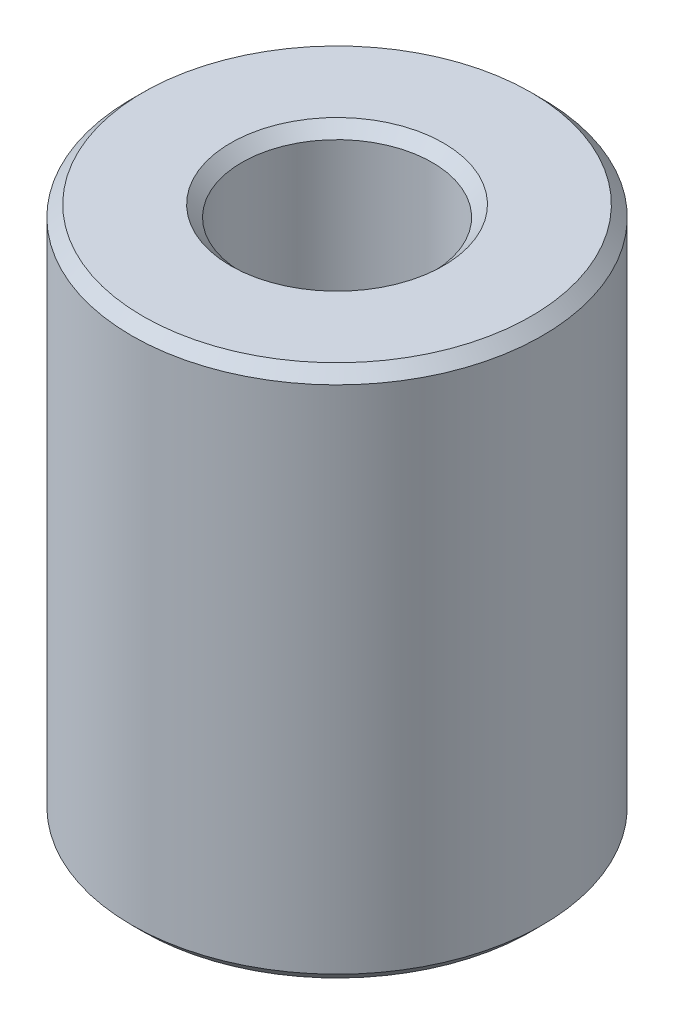
ISO-10303-21;
HEADER;
FILE_DESCRIPTION(('STEP AP214'),'2;1');
FILE_NAME('part.step','',(''),(''),'','','');
FILE_SCHEMA(('AUTOMOTIVE_DESIGN { 1 0 10303 214 1 1 1 1 }'));
ENDSEC;
DATA;
#1=APPLICATION_CONTEXT('core data for automotive mechanical design processes');
#2=APPLICATION_PROTOCOL_DEFINITION('international standard','automotive_design',2000,#1);
#3=PRODUCT_CONTEXT('',#1,'mechanical');
#4=PRODUCT('Part','Part','',(#3));
#5=PRODUCT_RELATED_PRODUCT_CATEGORY('part','',(#4));
#6=PRODUCT_DEFINITION_FORMATION('','',#4);
#7=PRODUCT_DEFINITION_CONTEXT('part definition',#1,'design');
#8=PRODUCT_DEFINITION('design','',#6,#7);
#9=PRODUCT_DEFINITION_SHAPE('','',#8);
#10=(LENGTH_UNIT() NAMED_UNIT(*) SI_UNIT(.MILLI.,.METRE.));
#11=(NAMED_UNIT(*) PLANE_ANGLE_UNIT() SI_UNIT($,.RADIAN.));
#12=(NAMED_UNIT(*) SI_UNIT($,.STERADIAN.) SOLID_ANGLE_UNIT());
#13=UNCERTAINTY_MEASURE_WITH_UNIT(LENGTH_MEASURE(1.E-05),#10,'distance_accuracy_value','');
#14=(GEOMETRIC_REPRESENTATION_CONTEXT(3) GLOBAL_UNCERTAINTY_ASSIGNED_CONTEXT((#13)) GLOBAL_UNIT_ASSIGNED_CONTEXT((#10,
#11,#12)) REPRESENTATION_CONTEXT('',''));
#15=CARTESIAN_POINT('',(0.,0.,0.));
#16=DIRECTION('',(0.,0.,1.));
#17=DIRECTION('',(1.,0.,0.));
#18=AXIS2_PLACEMENT_3D('',#15,#16,#17);
#19=CARTESIAN_POINT('',(0.,19.4729031962905,0.));
#20=DIRECTION('',(0.,-1.,0.));
#21=DIRECTION('',(0.,0.,-1.));
#22=AXIS2_PLACEMENT_3D('',#19,#20,#21);
#23=CYLINDRICAL_SURFACE('',#22,7.5);
#24=CARTESIAN_POINT('',(0.,0.410540021383046,0.));
#25=DIRECTION('',(0.,1.,0.));
#26=DIRECTION('',(0.,0.,1.));
#27=AXIS2_PLACEMENT_3D('',#24,#25,#26);
#28=CIRCLE('',#27,7.5);
#29=CARTESIAN_POINT('',(0.,0.410540021383046,7.5));
#30=VERTEX_POINT('',#29);
#31=EDGE_CURVE('E10',#30,#30,#28,.T.);
#32=ORIENTED_EDGE('',*,*,#31,.T.);
#33=EDGE_LOOP('',(#32));
#34=FACE_BOUND('',#33,.T.);
#35=CARTESIAN_POINT('',(0.,19.0623631749074,0.));
#36=DIRECTION('',(0.,1.,0.));
#37=DIRECTION('',(0.,0.,1.));
#38=AXIS2_PLACEMENT_3D('',#35,#36,#37);
#39=CIRCLE('',#38,7.5);
#40=CARTESIAN_POINT('',(0.,19.0623631749074,7.5));
#41=VERTEX_POINT('',#40);
#42=EDGE_CURVE('E50',#41,#41,#39,.F.);
#43=ORIENTED_EDGE('',*,*,#42,.T.);
#44=EDGE_LOOP('',(#43));
#45=FACE_BOUND('',#44,.T.);
#46=ADVANCED_FACE('F39',(#34,#45),#23,.T.);
#47=CARTESIAN_POINT('',(0.,19.4729031962905,0.));
#48=DIRECTION('',(0.,1.,0.));
#49=DIRECTION('',(0.,0.,1.));
#50=AXIS2_PLACEMENT_3D('',#47,#48,#49);
#51=PLANE('',#50);
#52=CARTESIAN_POINT('',(0.,19.4729031962905,0.));
#53=DIRECTION('',(0.,1.,0.));
#54=DIRECTION('',(0.,0.,1.));
#55=AXIS2_PLACEMENT_3D('',#52,#53,#54);
#56=CIRCLE('',#55,3.88848088473469);
#57=CARTESIAN_POINT('',(0.,19.4729031962905,3.88848088473469));
#58=VERTEX_POINT('',#57);
#59=EDGE_CURVE('E58',#58,#58,#56,.F.);
#60=ORIENTED_EDGE('',*,*,#59,.T.);
#61=EDGE_LOOP('',(#60));
#62=FACE_BOUND('',#61,.T.);
#63=CARTESIAN_POINT('',(0.,19.4729031962905,0.));
#64=DIRECTION('',(0.,1.,0.));
#65=DIRECTION('',(0.,0.,1.));
#66=AXIS2_PLACEMENT_3D('',#63,#64,#65);
#67=CIRCLE('',#66,7.08945997861696);
#68=CARTESIAN_POINT('',(0.,19.4729031962905,7.08945997861696));
#69=VERTEX_POINT('',#68);
#70=EDGE_CURVE('E61',#69,#69,#67,.T.);
#71=ORIENTED_EDGE('',*,*,#70,.T.);
#72=EDGE_LOOP('',(#71));
#73=FACE_BOUND('',#72,.T.);
#74=ADVANCED_FACE('F88',(#62,#73),#51,.T.);
#75=CARTESIAN_POINT('',(0.,0.,0.));
#76=DIRECTION('',(0.,1.,0.));
#77=DIRECTION('',(0.,0.,1.));
#78=AXIS2_PLACEMENT_3D('',#75,#76,#77);
#79=PLANE('',#78);
#80=CARTESIAN_POINT('',(0.,0.,0.));
#81=DIRECTION('',(0.,1.,0.));
#82=DIRECTION('',(0.,0.,1.));
#83=AXIS2_PLACEMENT_3D('',#80,#81,#82);
#84=CIRCLE('',#83,3.88848088473469);
#85=CARTESIAN_POINT('',(0.,0.,3.88848088473469));
#86=VERTEX_POINT('',#85);
#87=EDGE_CURVE('E51',#86,#86,#84,.T.);
#88=ORIENTED_EDGE('',*,*,#87,.T.);
#89=EDGE_LOOP('',(#88));
#90=FACE_BOUND('',#89,.T.);
#91=CARTESIAN_POINT('',(0.,0.,0.));
#92=DIRECTION('',(0.,1.,0.));
#93=DIRECTION('',(0.,0.,1.));
#94=AXIS2_PLACEMENT_3D('',#91,#92,#93);
#95=CIRCLE('',#94,7.08945997861695);
#96=CARTESIAN_POINT('',(0.,0.,7.08945997861695));
#97=VERTEX_POINT('',#96);
#98=EDGE_CURVE('E54',#97,#97,#95,.F.);
#99=ORIENTED_EDGE('',*,*,#98,.T.);
#100=EDGE_LOOP('',(#99));
#101=FACE_BOUND('',#100,.T.);
#102=ADVANCED_FACE('F83',(#90,#101),#79,.F.);
#103=CARTESIAN_POINT('',(0.,19.4729031962905,0.));
#104=DIRECTION('',(0.,-1.,0.));
#105=DIRECTION('',(0.,0.,-1.));
#106=AXIS2_PLACEMENT_3D('',#103,#104,#105);
#107=CYLINDRICAL_SURFACE('',#106,3.47794086335165);
#108=CARTESIAN_POINT('',(0.,19.0623631749074,0.));
#109=DIRECTION('',(0.,1.,0.));
#110=DIRECTION('',(0.,0.,1.));
#111=AXIS2_PLACEMENT_3D('',#108,#109,#110);
#112=CIRCLE('',#111,3.47794086335165);
#113=CARTESIAN_POINT('',(0.,19.0623631749074,3.47794086335165));
#114=VERTEX_POINT('',#113);
#115=EDGE_CURVE('E67',#114,#114,#112,.T.);
#116=ORIENTED_EDGE('',*,*,#115,.T.);
#117=EDGE_LOOP('',(#116));
#118=FACE_BOUND('',#117,.T.);
#119=CARTESIAN_POINT('',(0.,0.410540021383049,0.));
#120=DIRECTION('',(0.,1.,0.));
#121=DIRECTION('',(0.,0.,1.));
#122=AXIS2_PLACEMENT_3D('',#119,#120,#121);
#123=CIRCLE('',#122,3.47794086335165);
#124=CARTESIAN_POINT('',(0.,0.410540021383049,3.47794086335165));
#125=VERTEX_POINT('',#124);
#126=EDGE_CURVE('E69',#125,#125,#123,.F.);
#127=ORIENTED_EDGE('',*,*,#126,.T.);
#128=EDGE_LOOP('',(#127));
#129=FACE_BOUND('',#128,.T.);
#130=ADVANCED_FACE('F71',(#118,#129),#107,.F.);
#131=CARTESIAN_POINT('',(0.,19.0623631749074,0.));
#132=DIRECTION('',(0.,1.,0.));
#133=DIRECTION('',(0.,0.,1.));
#134=AXIS2_PLACEMENT_3D('',#131,#132,#133);
#135=CONICAL_SURFACE('',#134,3.47794086335165,0.785398163397448);
#136=ORIENTED_EDGE('',*,*,#59,.F.);
#137=EDGE_LOOP('',(#136));
#138=FACE_BOUND('',#137,.T.);
#139=ORIENTED_EDGE('',*,*,#115,.F.);
#140=EDGE_LOOP('',(#139));
#141=FACE_BOUND('',#140,.T.);
#142=ADVANCED_FACE('F77',(#138,#141),#135,.F.);
#143=CARTESIAN_POINT('',(0.,0.,0.));
#144=DIRECTION('',(0.,-1.,0.));
#145=DIRECTION('',(0.,0.,-1.));
#146=AXIS2_PLACEMENT_3D('',#143,#144,#145);
#147=CONICAL_SURFACE('',#146,3.88848088473469,0.785398163397445);
#148=ORIENTED_EDGE('',*,*,#126,.F.);
#149=EDGE_LOOP('',(#148));
#150=FACE_BOUND('',#149,.T.);
#151=ORIENTED_EDGE('',*,*,#87,.F.);
#152=EDGE_LOOP('',(#151));
#153=FACE_BOUND('',#152,.T.);
#154=ADVANCED_FACE('F73',(#150,#153),#147,.F.);
#155=CARTESIAN_POINT('',(0.,0.410540021383046,0.));
#156=DIRECTION('',(0.,1.,0.));
#157=DIRECTION('',(0.,0.,1.));
#158=AXIS2_PLACEMENT_3D('',#155,#156,#157);
#159=CONICAL_SURFACE('',#158,7.5,0.785398163397448);
#160=ORIENTED_EDGE('',*,*,#98,.F.);
#161=EDGE_LOOP('',(#160));
#162=FACE_BOUND('',#161,.T.);
#163=ORIENTED_EDGE('',*,*,#31,.F.);
#164=EDGE_LOOP('',(#163));
#165=FACE_BOUND('',#164,.T.);
#166=ADVANCED_FACE('F76',(#162,#165),#159,.T.);
#167=CARTESIAN_POINT('',(0.,19.4729031962905,0.));
#168=DIRECTION('',(0.,-1.,0.));
#169=DIRECTION('',(0.,0.,-1.));
#170=AXIS2_PLACEMENT_3D('',#167,#168,#169);
#171=CONICAL_SURFACE('',#170,7.08945997861696,0.785398163397444);
#172=ORIENTED_EDGE('',*,*,#42,.F.);
#173=EDGE_LOOP('',(#172));
#174=FACE_BOUND('',#173,.T.);
#175=ORIENTED_EDGE('',*,*,#70,.F.);
#176=EDGE_LOOP('',(#175));
#177=FACE_BOUND('',#176,.T.);
#178=ADVANCED_FACE('F45',(#174,#177),#171,.T.);
#179=CLOSED_SHELL('',(#46,#74,#102,#130,#142,#154,#166,#178));
#180=MANIFOLD_SOLID_BREP('B2',#179);
#181=ADVANCED_BREP_SHAPE_REPRESENTATION('',(#18,#180),#14);
#182=SHAPE_DEFINITION_REPRESENTATION(#9,#181);
ENDSEC;
END-ISO-10303-21;
